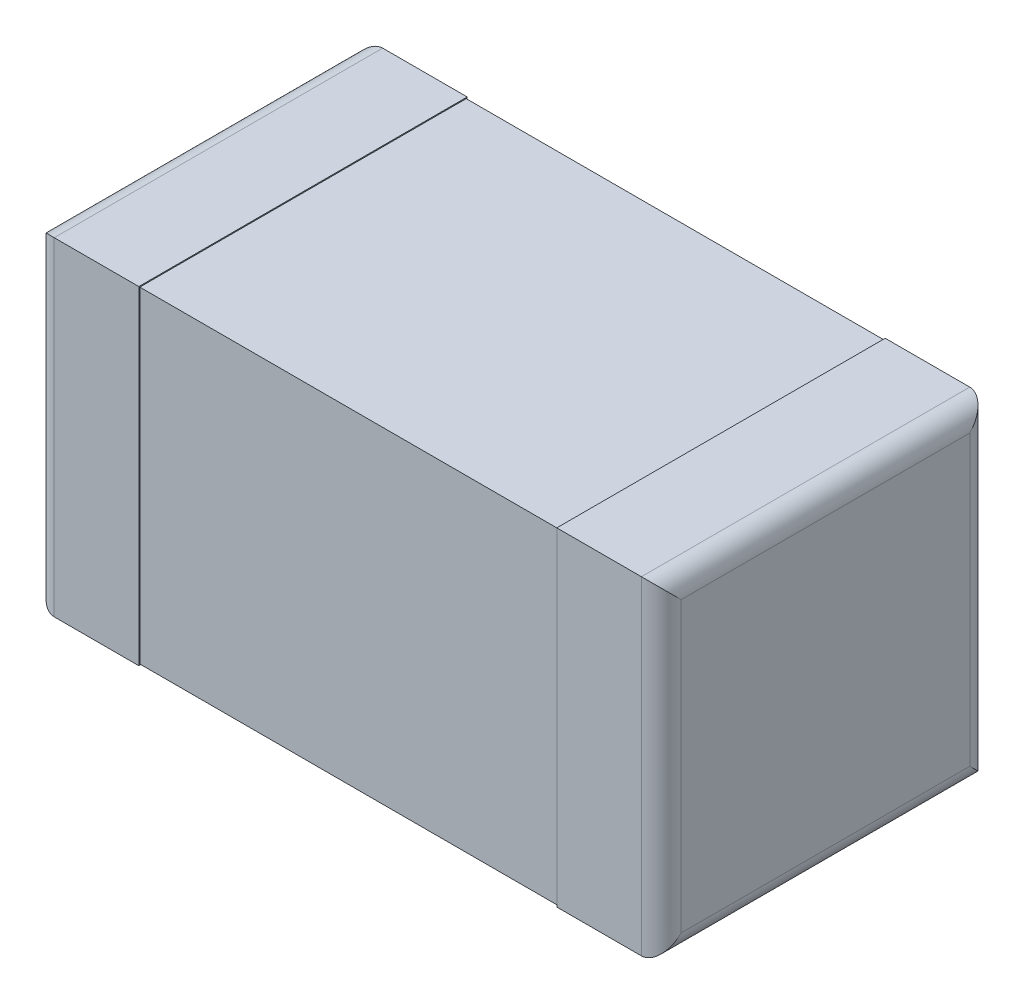
ISO-10303-21;
HEADER;
FILE_DESCRIPTION(('STEP AP214'),'2;1');
FILE_NAME('part.step','',(''),(''),'','','');
FILE_SCHEMA(('AUTOMOTIVE_DESIGN { 1 0 10303 214 1 1 1 1 }'));
ENDSEC;
DATA;
#1=APPLICATION_CONTEXT('core data for automotive mechanical design processes');
#2=APPLICATION_PROTOCOL_DEFINITION('international standard','automotive_design',2000,#1);
#3=PRODUCT_CONTEXT('',#1,'mechanical');
#4=PRODUCT('Part','Part','',(#3));
#5=PRODUCT_RELATED_PRODUCT_CATEGORY('part','',(#4));
#6=PRODUCT_DEFINITION_FORMATION('','',#4);
#7=PRODUCT_DEFINITION_CONTEXT('part definition',#1,'design');
#8=PRODUCT_DEFINITION('design','',#6,#7);
#9=PRODUCT_DEFINITION_SHAPE('','',#8);
#10=(LENGTH_UNIT() NAMED_UNIT(*) SI_UNIT(.MILLI.,.METRE.));
#11=(NAMED_UNIT(*) PLANE_ANGLE_UNIT() SI_UNIT($,.RADIAN.));
#12=(NAMED_UNIT(*) SI_UNIT($,.STERADIAN.) SOLID_ANGLE_UNIT());
#13=UNCERTAINTY_MEASURE_WITH_UNIT(LENGTH_MEASURE(1.E-05),#10,'distance_accuracy_value','');
#14=(GEOMETRIC_REPRESENTATION_CONTEXT(3) GLOBAL_UNCERTAINTY_ASSIGNED_CONTEXT((#13)) GLOBAL_UNIT_ASSIGNED_CONTEXT((#10,
#11,#12)) REPRESENTATION_CONTEXT('',''));
#15=CARTESIAN_POINT('',(0.,0.,0.));
#16=DIRECTION('',(0.,0.,1.));
#17=DIRECTION('',(1.,0.,0.));
#18=AXIS2_PLACEMENT_3D('',#15,#16,#17);
#19=CARTESIAN_POINT('',(0.,0.8382,0.8382));
#20=DIRECTION('',(1.,0.,0.));
#21=DIRECTION('',(0.,1.,0.));
#22=AXIS2_PLACEMENT_3D('',#19,#20,#21);
#23=PLANE('',#22);
#24=DIRECTION('',(0.,0.,-1.));
#25=VECTOR('',#24,1.);
#26=CARTESIAN_POINT('',(0.,0.0508,0.8382));
#27=LINE('',#26,#25);
#28=CARTESIAN_POINT('',(0.,0.0508,0.7874));
#29=VERTEX_POINT('',#28);
#30=CARTESIAN_POINT('',(0.,0.0508,0.0508));
#31=VERTEX_POINT('',#30);
#32=EDGE_CURVE('E195',#29,#31,#27,.T.);
#33=ORIENTED_EDGE('',*,*,#32,.F.);
#34=DIRECTION('',(0.,1.,0.));
#35=VECTOR('',#34,1.);
#36=CARTESIAN_POINT('',(0.,0.,0.7874));
#37=LINE('',#36,#35);
#38=CARTESIAN_POINT('',(0.,0.7874,0.7874));
#39=VERTEX_POINT('',#38);
#40=EDGE_CURVE('E154',#39,#29,#37,.F.);
#41=ORIENTED_EDGE('',*,*,#40,.F.);
#42=DIRECTION('',(0.,0.,-1.));
#43=VECTOR('',#42,1.);
#44=CARTESIAN_POINT('',(0.,0.7874,0.8382));
#45=LINE('',#44,#43);
#46=CARTESIAN_POINT('',(0.,0.7874,0.0508));
#47=VERTEX_POINT('',#46);
#48=EDGE_CURVE('E151',#47,#39,#45,.F.);
#49=ORIENTED_EDGE('',*,*,#48,.F.);
#50=DIRECTION('',(0.,-1.,0.));
#51=VECTOR('',#50,1.);
#52=CARTESIAN_POINT('',(0.,0.8382,0.0508));
#53=LINE('',#52,#51);
#54=EDGE_CURVE('E193',#31,#47,#53,.F.);
#55=ORIENTED_EDGE('',*,*,#54,.F.);
#56=EDGE_LOOP('',(#33,#41,#49,#55));
#57=FACE_BOUND('',#56,.T.);
#58=ADVANCED_FACE('F17',(#57),#23,.F.);
#59=CARTESIAN_POINT('',(1.6002,0.,0.8382));
#60=DIRECTION('',(-1.,0.,0.));
#61=DIRECTION('',(0.,0.,1.));
#62=AXIS2_PLACEMENT_3D('',#59,#60,#61);
#63=PLANE('',#62);
#64=DIRECTION('',(0.,0.,-1.));
#65=VECTOR('',#64,1.);
#66=CARTESIAN_POINT('',(1.6002,0.7874,0.8382));
#67=LINE('',#66,#65);
#68=CARTESIAN_POINT('',(1.6002,0.7874,0.7874));
#69=VERTEX_POINT('',#68);
#70=CARTESIAN_POINT('',(1.6002,0.7874,0.0508));
#71=VERTEX_POINT('',#70);
#72=EDGE_CURVE('E181',#69,#71,#67,.T.);
#73=ORIENTED_EDGE('',*,*,#72,.F.);
#74=DIRECTION('',(0.,-1.,0.));
#75=VECTOR('',#74,1.);
#76=CARTESIAN_POINT('',(1.6002,0.,0.7874));
#77=LINE('',#76,#75);
#78=CARTESIAN_POINT('',(1.6002,0.0508,0.7874));
#79=VERTEX_POINT('',#78);
#80=EDGE_CURVE('E185',#79,#69,#77,.F.);
#81=ORIENTED_EDGE('',*,*,#80,.F.);
#82=DIRECTION('',(0.,0.,-1.));
#83=VECTOR('',#82,1.);
#84=CARTESIAN_POINT('',(1.6002,0.0508,0.8382));
#85=LINE('',#84,#83);
#86=CARTESIAN_POINT('',(1.6002,0.0508,0.0508));
#87=VERTEX_POINT('',#86);
#88=EDGE_CURVE('E189',#87,#79,#85,.F.);
#89=ORIENTED_EDGE('',*,*,#88,.F.);
#90=DIRECTION('',(0.,1.,0.));
#91=VECTOR('',#90,1.);
#92=CARTESIAN_POINT('',(1.6002,0.,0.0508));
#93=LINE('',#92,#91);
#94=EDGE_CURVE('E138',#71,#87,#93,.F.);
#95=ORIENTED_EDGE('',*,*,#94,.F.);
#96=EDGE_LOOP('',(#73,#81,#89,#95));
#97=FACE_BOUND('',#96,.T.);
#98=ADVANCED_FACE('F340',(#97),#63,.F.);
#99=CARTESIAN_POINT('',(0.0508,0.7874,0.8382));
#100=DIRECTION('',(0.,0.,-1.));
#101=DIRECTION('',(-1.,0.,0.));
#102=AXIS2_PLACEMENT_3D('',#99,#100,#101);
#103=CYLINDRICAL_SURFACE('',#102,0.0508);
#104=CARTESIAN_POINT('',(0.0508,0.7874,0.7874));
#105=DIRECTION('',(0.,0.707106781186547,-0.707106781186547));
#106=DIRECTION('',(0.,0.707106781186547,0.707106781186547));
#107=AXIS2_PLACEMENT_3D('',#104,#105,#106);
#108=ELLIPSE('',#107,0.0718420489685532,0.0508);
#109=CARTESIAN_POINT('',(0.0508,0.8382,0.8382));
#110=VERTEX_POINT('',#109);
#111=EDGE_CURVE('E20',#110,#39,#108,.F.);
#112=ORIENTED_EDGE('',*,*,#111,.F.);
#113=DIRECTION('',(0.,0.,1.));
#114=VECTOR('',#113,1.);
#115=CARTESIAN_POINT('',(0.0507999999999999,0.8382,0.8382));
#116=LINE('',#115,#114);
#117=CARTESIAN_POINT('',(0.0508,0.8382,0.));
#118=VERTEX_POINT('',#117);
#119=EDGE_CURVE('E127',#110,#118,#116,.F.);
#120=ORIENTED_EDGE('',*,*,#119,.T.);
#121=CARTESIAN_POINT('',(0.0508,0.7874,0.0508));
#122=DIRECTION('',(0.,-0.707106781186547,-0.707106781186547));
#123=DIRECTION('',(0.,-0.707106781186547,0.707106781186547));
#124=AXIS2_PLACEMENT_3D('',#121,#122,#123);
#125=ELLIPSE('',#124,0.0718420489685532,0.0508);
#126=EDGE_CURVE('E194',#47,#118,#125,.T.);
#127=ORIENTED_EDGE('',*,*,#126,.F.);
#128=ORIENTED_EDGE('',*,*,#48,.T.);
#129=EDGE_LOOP('',(#112,#120,#127,#128));
#130=FACE_BOUND('',#129,.T.);
#131=ADVANCED_FACE('F150',(#130),#103,.T.);
#132=CARTESIAN_POINT('',(0.0508,0.,0.7874));
#133=DIRECTION('',(0.,1.,0.));
#134=DIRECTION('',(-1.,0.,0.));
#135=AXIS2_PLACEMENT_3D('',#132,#133,#134);
#136=CYLINDRICAL_SURFACE('',#135,0.0508);
#137=CARTESIAN_POINT('',(0.0508,0.0508,0.7874));
#138=DIRECTION('',(0.,-0.707106781186547,-0.707106781186547));
#139=DIRECTION('',(0.,0.707106781186547,-0.707106781186547));
#140=AXIS2_PLACEMENT_3D('',#137,#138,#139);
#141=ELLIPSE('',#140,0.0718420489685532,0.0508);
#142=CARTESIAN_POINT('',(0.0507999999999999,0.,0.8382));
#143=VERTEX_POINT('',#142);
#144=EDGE_CURVE('E157',#143,#29,#141,.T.);
#145=ORIENTED_EDGE('',*,*,#144,.F.);
#146=DIRECTION('',(0.,1.,0.));
#147=VECTOR('',#146,1.);
#148=CARTESIAN_POINT('',(0.0507999999999999,0.,0.8382));
#149=LINE('',#148,#147);
#150=EDGE_CURVE('E144',#110,#143,#149,.F.);
#151=ORIENTED_EDGE('',*,*,#150,.F.);
#152=ORIENTED_EDGE('',*,*,#111,.T.);
#153=ORIENTED_EDGE('',*,*,#40,.T.);
#154=EDGE_LOOP('',(#145,#151,#152,#153));
#155=FACE_BOUND('',#154,.T.);
#156=ADVANCED_FACE('F155',(#155),#136,.T.);
#157=CARTESIAN_POINT('',(0.0508,0.0508,0.8382));
#158=DIRECTION('',(0.,0.,-1.));
#159=DIRECTION('',(-1.,0.,0.));
#160=AXIS2_PLACEMENT_3D('',#157,#158,#159);
#161=CYLINDRICAL_SURFACE('',#160,0.0508);
#162=CARTESIAN_POINT('',(0.0508,0.0508,0.0508));
#163=DIRECTION('',(0.,-0.707106781186547,0.707106781186547));
#164=DIRECTION('',(0.,-0.707106781186547,-0.707106781186547));
#165=AXIS2_PLACEMENT_3D('',#162,#163,#164);
#166=ELLIPSE('',#165,0.0718420489685532,0.0508);
#167=CARTESIAN_POINT('',(0.0508,0.,0.));
#168=VERTEX_POINT('',#167);
#169=EDGE_CURVE('E190',#168,#31,#166,.F.);
#170=ORIENTED_EDGE('',*,*,#169,.F.);
#171=DIRECTION('',(0.,0.,1.));
#172=VECTOR('',#171,1.);
#173=CARTESIAN_POINT('',(0.0508,0.,0.8382));
#174=LINE('',#173,#172);
#175=EDGE_CURVE('E159',#168,#143,#174,.T.);
#176=ORIENTED_EDGE('',*,*,#175,.T.);
#177=ORIENTED_EDGE('',*,*,#144,.T.);
#178=ORIENTED_EDGE('',*,*,#32,.T.);
#179=EDGE_LOOP('',(#170,#176,#177,#178));
#180=FACE_BOUND('',#179,.T.);
#181=ADVANCED_FACE('F545',(#180),#161,.T.);
#182=CARTESIAN_POINT('',(0.0508,0.8382,0.0508));
#183=DIRECTION('',(0.,-1.,0.));
#184=DIRECTION('',(1.,0.,0.));
#185=AXIS2_PLACEMENT_3D('',#182,#183,#184);
#186=CYLINDRICAL_SURFACE('',#185,0.0508);
#187=ORIENTED_EDGE('',*,*,#169,.T.);
#188=ORIENTED_EDGE('',*,*,#54,.T.);
#189=ORIENTED_EDGE('',*,*,#126,.T.);
#190=DIRECTION('',(0.,1.,0.));
#191=VECTOR('',#190,1.);
#192=CARTESIAN_POINT('',(0.0507999999999999,0.,0.));
#193=LINE('',#192,#191);
#194=EDGE_CURVE('E214',#118,#168,#193,.F.);
#195=ORIENTED_EDGE('',*,*,#194,.T.);
#196=EDGE_LOOP('',(#187,#188,#189,#195));
#197=FACE_BOUND('',#196,.T.);
#198=ADVANCED_FACE('F354',(#197),#186,.T.);
#199=CARTESIAN_POINT('',(1.5494,0.0508,0.8382));
#200=DIRECTION('',(0.,0.,-1.));
#201=DIRECTION('',(-1.,0.,0.));
#202=AXIS2_PLACEMENT_3D('',#199,#200,#201);
#203=CYLINDRICAL_SURFACE('',#202,0.0508);
#204=CARTESIAN_POINT('',(1.5494,0.0508,0.7874));
#205=DIRECTION('',(0.,-0.707106781186547,-0.707106781186547));
#206=DIRECTION('',(0.,-0.707106781186547,0.707106781186547));
#207=AXIS2_PLACEMENT_3D('',#204,#205,#206);
#208=ELLIPSE('',#207,0.0718420489685532,0.0508);
#209=CARTESIAN_POINT('',(1.5494,0.,0.8382));
#210=VERTEX_POINT('',#209);
#211=EDGE_CURVE('E186',#210,#79,#208,.F.);
#212=ORIENTED_EDGE('',*,*,#211,.F.);
#213=DIRECTION('',(0.,0.,1.));
#214=VECTOR('',#213,1.);
#215=CARTESIAN_POINT('',(1.5494,0.,0.8382));
#216=LINE('',#215,#214);
#217=CARTESIAN_POINT('',(1.5494,0.,0.));
#218=VERTEX_POINT('',#217);
#219=EDGE_CURVE('E213',#210,#218,#216,.F.);
#220=ORIENTED_EDGE('',*,*,#219,.T.);
#221=CARTESIAN_POINT('',(1.5494,0.0508,0.0508));
#222=DIRECTION('',(0.,0.707106781186547,-0.707106781186547));
#223=DIRECTION('',(0.,0.707106781186547,0.707106781186547));
#224=AXIS2_PLACEMENT_3D('',#221,#222,#223);
#225=ELLIPSE('',#224,0.0718420489685532,0.0508);
#226=EDGE_CURVE('E179',#87,#218,#225,.T.);
#227=ORIENTED_EDGE('',*,*,#226,.F.);
#228=ORIENTED_EDGE('',*,*,#88,.T.);
#229=EDGE_LOOP('',(#212,#220,#227,#228));
#230=FACE_BOUND('',#229,.T.);
#231=ADVANCED_FACE('F343',(#230),#203,.T.);
#232=CARTESIAN_POINT('',(1.5494,0.,0.7874));
#233=DIRECTION('',(0.,-1.,0.));
#234=DIRECTION('',(0.,0.,-1.));
#235=AXIS2_PLACEMENT_3D('',#232,#233,#234);
#236=CYLINDRICAL_SURFACE('',#235,0.0508);
#237=CARTESIAN_POINT('',(1.5494,0.7874,0.7874));
#238=DIRECTION('',(0.,0.707106781186547,-0.707106781186547));
#239=DIRECTION('',(0.,-0.707106781186547,-0.707106781186547));
#240=AXIS2_PLACEMENT_3D('',#237,#238,#239);
#241=ELLIPSE('',#240,0.0718420489685532,0.0508);
#242=CARTESIAN_POINT('',(1.5494,0.8382,0.8382));
#243=VERTEX_POINT('',#242);
#244=EDGE_CURVE('E182',#243,#69,#241,.T.);
#245=ORIENTED_EDGE('',*,*,#244,.F.);
#246=DIRECTION('',(0.,1.,0.));
#247=VECTOR('',#246,1.);
#248=CARTESIAN_POINT('',(1.5494,0.,0.8382));
#249=LINE('',#248,#247);
#250=EDGE_CURVE('E234',#210,#243,#249,.T.);
#251=ORIENTED_EDGE('',*,*,#250,.F.);
#252=ORIENTED_EDGE('',*,*,#211,.T.);
#253=ORIENTED_EDGE('',*,*,#80,.T.);
#254=EDGE_LOOP('',(#245,#251,#252,#253));
#255=FACE_BOUND('',#254,.T.);
#256=ADVANCED_FACE('F345',(#255),#236,.T.);
#257=CARTESIAN_POINT('',(1.5494,0.7874,0.8382));
#258=DIRECTION('',(0.,0.,-1.));
#259=DIRECTION('',(-1.,0.,0.));
#260=AXIS2_PLACEMENT_3D('',#257,#258,#259);
#261=CYLINDRICAL_SURFACE('',#260,0.0508);
#262=CARTESIAN_POINT('',(1.5494,0.7874,0.0508));
#263=DIRECTION('',(0.,0.707106781186547,0.707106781186547));
#264=DIRECTION('',(0.,0.707106781186547,-0.707106781186547));
#265=AXIS2_PLACEMENT_3D('',#262,#263,#264);
#266=ELLIPSE('',#265,0.0718420489685532,0.0508);
#267=CARTESIAN_POINT('',(1.5494,0.8382,0.));
#268=VERTEX_POINT('',#267);
#269=EDGE_CURVE('E176',#268,#71,#266,.F.);
#270=ORIENTED_EDGE('',*,*,#269,.F.);
#271=DIRECTION('',(0.,0.,1.));
#272=VECTOR('',#271,1.);
#273=CARTESIAN_POINT('',(1.5494,0.8382,0.8382));
#274=LINE('',#273,#272);
#275=EDGE_CURVE('E237',#268,#243,#274,.T.);
#276=ORIENTED_EDGE('',*,*,#275,.T.);
#277=ORIENTED_EDGE('',*,*,#244,.T.);
#278=ORIENTED_EDGE('',*,*,#72,.T.);
#279=EDGE_LOOP('',(#270,#276,#277,#278));
#280=FACE_BOUND('',#279,.T.);
#281=ADVANCED_FACE('F333',(#280),#261,.T.);
#282=CARTESIAN_POINT('',(1.5494,0.,0.0508));
#283=DIRECTION('',(0.,1.,0.));
#284=DIRECTION('',(0.,0.,1.));
#285=AXIS2_PLACEMENT_3D('',#282,#283,#284);
#286=CYLINDRICAL_SURFACE('',#285,0.0508);
#287=ORIENTED_EDGE('',*,*,#269,.T.);
#288=ORIENTED_EDGE('',*,*,#94,.T.);
#289=ORIENTED_EDGE('',*,*,#226,.T.);
#290=DIRECTION('',(0.,1.,0.));
#291=VECTOR('',#290,1.);
#292=CARTESIAN_POINT('',(1.5494,0.,0.));
#293=LINE('',#292,#291);
#294=EDGE_CURVE('E260',#218,#268,#293,.T.);
#295=ORIENTED_EDGE('',*,*,#294,.T.);
#296=EDGE_LOOP('',(#287,#288,#289,#295));
#297=FACE_BOUND('',#296,.T.);
#298=ADVANCED_FACE('F337',(#297),#286,.T.);
#299=CARTESIAN_POINT('',(1.6002,0.8382,0.8382));
#300=DIRECTION('',(0.,-1.,0.));
#301=DIRECTION('',(1.,0.,0.));
#302=AXIS2_PLACEMENT_3D('',#299,#300,#301);
#303=PLANE('',#302);
#304=ORIENTED_EDGE('',*,*,#119,.F.);
#305=DIRECTION('',(1.,0.,0.));
#306=VECTOR('',#305,1.);
#307=CARTESIAN_POINT('',(0.,0.8382,0.8382));
#308=LINE('',#307,#306);
#309=CARTESIAN_POINT('',(0.2667,0.8382,0.8382));
#310=VERTEX_POINT('',#309);
#311=EDGE_CURVE('E131',#310,#110,#308,.F.);
#312=ORIENTED_EDGE('',*,*,#311,.F.);
#313=DIRECTION('',(0.,0.,1.));
#314=VECTOR('',#313,1.);
#315=CARTESIAN_POINT('',(0.2667,0.8382,0.83566));
#316=LINE('',#315,#314);
#317=CARTESIAN_POINT('',(0.2667,0.8382,0.));
#318=VERTEX_POINT('',#317);
#319=EDGE_CURVE('E172',#318,#310,#316,.T.);
#320=ORIENTED_EDGE('',*,*,#319,.F.);
#321=DIRECTION('',(1.,0.,0.));
#322=VECTOR('',#321,1.);
#323=CARTESIAN_POINT('',(0.,0.8382,0.));
#324=LINE('',#323,#322);
#325=EDGE_CURVE('E133',#318,#118,#324,.F.);
#326=ORIENTED_EDGE('',*,*,#325,.T.);
#327=EDGE_LOOP('',(#304,#312,#320,#326));
#328=FACE_BOUND('',#327,.T.);
#329=ADVANCED_FACE('F129',(#328),#303,.F.);
#330=CARTESIAN_POINT('',(0.,0.,0.8382));
#331=DIRECTION('',(0.,0.,1.));
#332=DIRECTION('',(1.,0.,0.));
#333=AXIS2_PLACEMENT_3D('',#330,#331,#332);
#334=PLANE('',#333);
#335=DIRECTION('',(1.,0.,0.));
#336=VECTOR('',#335,1.);
#337=CARTESIAN_POINT('',(0.,0.,0.8382));
#338=LINE('',#337,#336);
#339=CARTESIAN_POINT('',(0.2667,0.,0.8382));
#340=VERTEX_POINT('',#339);
#341=EDGE_CURVE('E162',#143,#340,#338,.T.);
#342=ORIENTED_EDGE('',*,*,#341,.T.);
#343=DIRECTION('',(0.,1.,0.));
#344=VECTOR('',#343,1.);
#345=CARTESIAN_POINT('',(0.2667,0.,0.8382));
#346=LINE('',#345,#344);
#347=EDGE_CURVE('E146',#310,#340,#346,.F.);
#348=ORIENTED_EDGE('',*,*,#347,.F.);
#349=ORIENTED_EDGE('',*,*,#311,.T.);
#350=ORIENTED_EDGE('',*,*,#150,.T.);
#351=EDGE_LOOP('',(#342,#348,#349,#350));
#352=FACE_BOUND('',#351,.T.);
#353=ADVANCED_FACE('F142',(#352),#334,.T.);
#354=CARTESIAN_POINT('',(0.,0.,0.8382));
#355=DIRECTION('',(0.,1.,0.));
#356=DIRECTION('',(0.,0.,1.));
#357=AXIS2_PLACEMENT_3D('',#354,#355,#356);
#358=PLANE('',#357);
#359=ORIENTED_EDGE('',*,*,#175,.F.);
#360=DIRECTION('',(1.,0.,0.));
#361=VECTOR('',#360,1.);
#362=CARTESIAN_POINT('',(0.,0.,0.));
#363=LINE('',#362,#361);
#364=CARTESIAN_POINT('',(0.2667,0.,0.));
#365=VERTEX_POINT('',#364);
#366=EDGE_CURVE('E210',#168,#365,#363,.T.);
#367=ORIENTED_EDGE('',*,*,#366,.T.);
#368=DIRECTION('',(0.,0.,1.));
#369=VECTOR('',#368,1.);
#370=CARTESIAN_POINT('',(0.2667,0.,0.83566));
#371=LINE('',#370,#369);
#372=EDGE_CURVE('E171',#340,#365,#371,.F.);
#373=ORIENTED_EDGE('',*,*,#372,.F.);
#374=ORIENTED_EDGE('',*,*,#341,.F.);
#375=EDGE_LOOP('',(#359,#367,#373,#374));
#376=FACE_BOUND('',#375,.T.);
#377=ADVANCED_FACE('F382',(#376),#358,.F.);
#378=CARTESIAN_POINT('',(0.,0.,0.));
#379=DIRECTION('',(0.,0.,1.));
#380=DIRECTION('',(1.,0.,0.));
#381=AXIS2_PLACEMENT_3D('',#378,#379,#380);
#382=PLANE('',#381);
#383=ORIENTED_EDGE('',*,*,#194,.F.);
#384=ORIENTED_EDGE('',*,*,#325,.F.);
#385=DIRECTION('',(0.,1.,0.));
#386=VECTOR('',#385,1.);
#387=CARTESIAN_POINT('',(0.2667,0.,0.));
#388=LINE('',#387,#386);
#389=EDGE_CURVE('E206',#365,#318,#388,.T.);
#390=ORIENTED_EDGE('',*,*,#389,.F.);
#391=ORIENTED_EDGE('',*,*,#366,.F.);
#392=EDGE_LOOP('',(#383,#384,#390,#391));
#393=FACE_BOUND('',#392,.T.);
#394=ADVANCED_FACE('F379',(#393),#382,.F.);
#395=CARTESIAN_POINT('',(0.,0.,0.8382));
#396=DIRECTION('',(0.,1.,0.));
#397=DIRECTION('',(0.,0.,1.));
#398=AXIS2_PLACEMENT_3D('',#395,#396,#397);
#399=PLANE('',#398);
#400=ORIENTED_EDGE('',*,*,#219,.F.);
#401=DIRECTION('',(1.,0.,0.));
#402=VECTOR('',#401,1.);
#403=CARTESIAN_POINT('',(0.,0.,0.8382));
#404=LINE('',#403,#402);
#405=CARTESIAN_POINT('',(1.3335,0.,0.8382));
#406=VERTEX_POINT('',#405);
#407=EDGE_CURVE('E231',#406,#210,#404,.T.);
#408=ORIENTED_EDGE('',*,*,#407,.F.);
#409=DIRECTION('',(0.,0.,1.));
#410=VECTOR('',#409,1.);
#411=CARTESIAN_POINT('',(1.3335,0.,0.83566));
#412=LINE('',#411,#410);
#413=CARTESIAN_POINT('',(1.3335,0.,0.));
#414=VERTEX_POINT('',#413);
#415=EDGE_CURVE('E228',#414,#406,#412,.T.);
#416=ORIENTED_EDGE('',*,*,#415,.F.);
#417=DIRECTION('',(1.,0.,0.));
#418=VECTOR('',#417,1.);
#419=CARTESIAN_POINT('',(0.,0.,0.));
#420=LINE('',#419,#418);
#421=EDGE_CURVE('E241',#414,#218,#420,.T.);
#422=ORIENTED_EDGE('',*,*,#421,.T.);
#423=EDGE_LOOP('',(#400,#408,#416,#422));
#424=FACE_BOUND('',#423,.T.);
#425=ADVANCED_FACE('F325',(#424),#399,.F.);
#426=CARTESIAN_POINT('',(0.,0.,0.8382));
#427=DIRECTION('',(0.,0.,1.));
#428=DIRECTION('',(1.,0.,0.));
#429=AXIS2_PLACEMENT_3D('',#426,#427,#428);
#430=PLANE('',#429);
#431=DIRECTION('',(1.,0.,0.));
#432=VECTOR('',#431,1.);
#433=CARTESIAN_POINT('',(1.6002,0.8382,0.8382));
#434=LINE('',#433,#432);
#435=CARTESIAN_POINT('',(1.3335,0.8382,0.8382));
#436=VERTEX_POINT('',#435);
#437=EDGE_CURVE('E238',#243,#436,#434,.F.);
#438=ORIENTED_EDGE('',*,*,#437,.T.);
#439=DIRECTION('',(0.,1.,0.));
#440=VECTOR('',#439,1.);
#441=CARTESIAN_POINT('',(1.3335,0.8382,0.8382));
#442=LINE('',#441,#440);
#443=EDGE_CURVE('E225',#406,#436,#442,.T.);
#444=ORIENTED_EDGE('',*,*,#443,.F.);
#445=ORIENTED_EDGE('',*,*,#407,.T.);
#446=ORIENTED_EDGE('',*,*,#250,.T.);
#447=EDGE_LOOP('',(#438,#444,#445,#446));
#448=FACE_BOUND('',#447,.T.);
#449=ADVANCED_FACE('F329',(#448),#430,.T.);
#450=CARTESIAN_POINT('',(1.6002,0.8382,0.8382));
#451=DIRECTION('',(0.,-1.,0.));
#452=DIRECTION('',(1.,0.,0.));
#453=AXIS2_PLACEMENT_3D('',#450,#451,#452);
#454=PLANE('',#453);
#455=ORIENTED_EDGE('',*,*,#275,.F.);
#456=DIRECTION('',(1.,0.,0.));
#457=VECTOR('',#456,1.);
#458=CARTESIAN_POINT('',(0.,0.8382,0.));
#459=LINE('',#458,#457);
#460=CARTESIAN_POINT('',(1.3335,0.8382,0.));
#461=VERTEX_POINT('',#460);
#462=EDGE_CURVE('E257',#268,#461,#459,.F.);
#463=ORIENTED_EDGE('',*,*,#462,.T.);
#464=DIRECTION('',(0.,0.,1.));
#465=VECTOR('',#464,1.);
#466=CARTESIAN_POINT('',(1.3335,0.8382,0.83566));
#467=LINE('',#466,#465);
#468=EDGE_CURVE('E227',#436,#461,#467,.F.);
#469=ORIENTED_EDGE('',*,*,#468,.F.);
#470=ORIENTED_EDGE('',*,*,#437,.F.);
#471=EDGE_LOOP('',(#455,#463,#469,#470));
#472=FACE_BOUND('',#471,.T.);
#473=ADVANCED_FACE('F319',(#472),#454,.F.);
#474=CARTESIAN_POINT('',(0.,0.,0.));
#475=DIRECTION('',(0.,0.,1.));
#476=DIRECTION('',(1.,0.,0.));
#477=AXIS2_PLACEMENT_3D('',#474,#475,#476);
#478=PLANE('',#477);
#479=ORIENTED_EDGE('',*,*,#294,.F.);
#480=ORIENTED_EDGE('',*,*,#421,.F.);
#481=DIRECTION('',(0.,1.,0.));
#482=VECTOR('',#481,1.);
#483=CARTESIAN_POINT('',(1.3335,0.8382,0.));
#484=LINE('',#483,#482);
#485=EDGE_CURVE('E249',#461,#414,#484,.F.);
#486=ORIENTED_EDGE('',*,*,#485,.F.);
#487=ORIENTED_EDGE('',*,*,#462,.F.);
#488=EDGE_LOOP('',(#479,#480,#486,#487));
#489=FACE_BOUND('',#488,.T.);
#490=ADVANCED_FACE('F323',(#489),#478,.F.);
#491=CARTESIAN_POINT('',(0.2667,1.99143127423469,0.0025399999999999));
#492=DIRECTION('',(0.,0.,-1.));
#493=DIRECTION('',(-1.,0.,0.));
#494=AXIS2_PLACEMENT_3D('',#491,#492,#493);
#495=PLANE('',#494);
#496=DIRECTION('',(1.,0.,0.));
#497=VECTOR('',#496,1.);
#498=CARTESIAN_POINT('',(0.2667,0.83566,0.00253999999999988));
#499=LINE('',#498,#497);
#500=CARTESIAN_POINT('',(0.2667,0.83566,0.00253999999999988));
#501=VERTEX_POINT('',#500);
#502=CARTESIAN_POINT('',(1.3335,0.83566,0.00253999999999989));
#503=VERTEX_POINT('',#502);
#504=EDGE_CURVE('E246',#501,#503,#499,.T.);
#505=ORIENTED_EDGE('',*,*,#504,.T.);
#506=DIRECTION('',(0.,1.,0.));
#507=VECTOR('',#506,1.);
#508=CARTESIAN_POINT('',(1.3335,0.8382,0.00253999999999988));
#509=LINE('',#508,#507);
#510=CARTESIAN_POINT('',(1.3335,0.00254000000000005,0.00253999999999989));
#511=VERTEX_POINT('',#510);
#512=EDGE_CURVE('E252',#511,#503,#509,.T.);
#513=ORIENTED_EDGE('',*,*,#512,.F.);
#514=DIRECTION('',(-1.,0.,0.));
#515=VECTOR('',#514,1.);
#516=CARTESIAN_POINT('',(1.3335,0.00254000000000001,0.00253999999999988));
#517=LINE('',#516,#515);
#518=CARTESIAN_POINT('',(0.2667,0.00254000000000004,0.00253999999999989));
#519=VERTEX_POINT('',#518);
#520=EDGE_CURVE('E203',#511,#519,#517,.T.);
#521=ORIENTED_EDGE('',*,*,#520,.T.);
#522=DIRECTION('',(0.,1.,0.));
#523=VECTOR('',#522,1.);
#524=CARTESIAN_POINT('',(0.2667,0.,0.00253999999999988));
#525=LINE('',#524,#523);
#526=EDGE_CURVE('E208',#501,#519,#525,.F.);
#527=ORIENTED_EDGE('',*,*,#526,.F.);
#528=EDGE_LOOP('',(#505,#513,#521,#527));
#529=FACE_BOUND('',#528,.T.);
#530=ADVANCED_FACE('F367',(#529),#495,.T.);
#531=CARTESIAN_POINT('',(1.3335,0.00254000000000001,-1.15577127423469));
#532=DIRECTION('',(0.,1.,0.));
#533=DIRECTION('',(-1.,0.,0.));
#534=AXIS2_PLACEMENT_3D('',#531,#532,#533);
#535=PLANE('',#534);
#536=DIRECTION('',(0.,0.,1.));
#537=VECTOR('',#536,1.);
#538=CARTESIAN_POINT('',(1.3335,0.00253999999999999,0.83566));
#539=LINE('',#538,#537);
#540=CARTESIAN_POINT('',(1.3335,0.00254,0.83566));
#541=VERTEX_POINT('',#540);
#542=EDGE_CURVE('E283',#541,#511,#539,.F.);
#543=ORIENTED_EDGE('',*,*,#542,.F.);
#544=DIRECTION('',(-1.,0.,0.));
#545=VECTOR('',#544,1.);
#546=CARTESIAN_POINT('',(0.,0.00254000000000001,0.83566));
#547=LINE('',#546,#545);
#548=CARTESIAN_POINT('',(0.2667,0.00253999999999996,0.83566));
#549=VERTEX_POINT('',#548);
#550=EDGE_CURVE('E286',#541,#549,#547,.T.);
#551=ORIENTED_EDGE('',*,*,#550,.T.);
#552=DIRECTION('',(0.,0.,1.));
#553=VECTOR('',#552,1.);
#554=CARTESIAN_POINT('',(0.2667,0.00254000000000009,0.83566));
#555=LINE('',#554,#553);
#556=EDGE_CURVE('E273',#519,#549,#555,.T.);
#557=ORIENTED_EDGE('',*,*,#556,.F.);
#558=ORIENTED_EDGE('',*,*,#520,.F.);
#559=EDGE_LOOP('',(#543,#551,#557,#558));
#560=FACE_BOUND('',#559,.T.);
#561=ADVANCED_FACE('F306',(#560),#535,.F.);
#562=CARTESIAN_POINT('',(0.2667,0.,0.83566));
#563=DIRECTION('',(1.,0.,0.));
#564=DIRECTION('',(0.,1.,0.));
#565=AXIS2_PLACEMENT_3D('',#562,#563,#564);
#566=PLANE('',#565);
#567=ORIENTED_EDGE('',*,*,#556,.T.);
#568=DIRECTION('',(0.,1.,0.));
#569=VECTOR('',#568,1.);
#570=CARTESIAN_POINT('',(0.2667,0.,0.83566));
#571=LINE('',#570,#569);
#572=CARTESIAN_POINT('',(0.2667,0.83566,0.83566));
#573=VERTEX_POINT('',#572);
#574=EDGE_CURVE('E289',#549,#573,#571,.T.);
#575=ORIENTED_EDGE('',*,*,#574,.T.);
#576=DIRECTION('',(0.,0.,-1.));
#577=VECTOR('',#576,1.);
#578=CARTESIAN_POINT('',(0.2667,0.83566,-1.15577127423469));
#579=LINE('',#578,#577);
#580=EDGE_CURVE('E275',#573,#501,#579,.T.);
#581=ORIENTED_EDGE('',*,*,#580,.T.);
#582=ORIENTED_EDGE('',*,*,#526,.T.);
#583=EDGE_LOOP('',(#567,#575,#581,#582));
#584=FACE_BOUND('',#583,.T.);
#585=ORIENTED_EDGE('',*,*,#372,.T.);
#586=ORIENTED_EDGE('',*,*,#389,.T.);
#587=ORIENTED_EDGE('',*,*,#319,.T.);
#588=ORIENTED_EDGE('',*,*,#347,.T.);
#589=EDGE_LOOP('',(#585,#586,#587,#588));
#590=FACE_BOUND('',#589,.T.);
#591=ADVANCED_FACE('F301',(#584,#590),#566,.T.);
#592=CARTESIAN_POINT('',(0.2667,0.83566,-1.15577127423469));
#593=DIRECTION('',(0.,-1.,0.));
#594=DIRECTION('',(0.,0.,-1.));
#595=AXIS2_PLACEMENT_3D('',#592,#593,#594);
#596=PLANE('',#595);
#597=ORIENTED_EDGE('',*,*,#580,.F.);
#598=DIRECTION('',(-1.,0.,0.));
#599=VECTOR('',#598,1.);
#600=CARTESIAN_POINT('',(0.,0.83566,0.83566));
#601=LINE('',#600,#599);
#602=CARTESIAN_POINT('',(1.3335,0.83566,0.83566));
#603=VERTEX_POINT('',#602);
#604=EDGE_CURVE('E26',#573,#603,#601,.F.);
#605=ORIENTED_EDGE('',*,*,#604,.T.);
#606=DIRECTION('',(0.,0.,1.));
#607=VECTOR('',#606,1.);
#608=CARTESIAN_POINT('',(1.3335,0.83566,0.83566));
#609=LINE('',#608,#607);
#610=EDGE_CURVE('E34',#503,#603,#609,.T.);
#611=ORIENTED_EDGE('',*,*,#610,.F.);
#612=ORIENTED_EDGE('',*,*,#504,.F.);
#613=EDGE_LOOP('',(#597,#605,#611,#612));
#614=FACE_BOUND('',#613,.T.);
#615=ADVANCED_FACE('F295',(#614),#596,.F.);
#616=CARTESIAN_POINT('',(1.3335,0.8382,0.83566));
#617=DIRECTION('',(-1.,0.,0.));
#618=DIRECTION('',(0.,0.,1.));
#619=AXIS2_PLACEMENT_3D('',#616,#617,#618);
#620=PLANE('',#619);
#621=DIRECTION('',(0.,1.,0.));
#622=VECTOR('',#621,1.);
#623=CARTESIAN_POINT('',(1.3335,0.,0.83566));
#624=LINE('',#623,#622);
#625=EDGE_CURVE('E11',#603,#541,#624,.F.);
#626=ORIENTED_EDGE('',*,*,#625,.T.);
#627=ORIENTED_EDGE('',*,*,#542,.T.);
#628=ORIENTED_EDGE('',*,*,#512,.T.);
#629=ORIENTED_EDGE('',*,*,#610,.T.);
#630=EDGE_LOOP('',(#626,#627,#628,#629));
#631=FACE_BOUND('',#630,.T.);
#632=ORIENTED_EDGE('',*,*,#468,.T.);
#633=ORIENTED_EDGE('',*,*,#485,.T.);
#634=ORIENTED_EDGE('',*,*,#415,.T.);
#635=ORIENTED_EDGE('',*,*,#443,.T.);
#636=EDGE_LOOP('',(#632,#633,#634,#635));
#637=FACE_BOUND('',#636,.T.);
#638=ADVANCED_FACE('F308',(#631,#637),#620,.T.);
#639=CARTESIAN_POINT('',(0.,0.,0.83566));
#640=DIRECTION('',(0.,0.,-1.));
#641=DIRECTION('',(-1.,0.,0.));
#642=AXIS2_PLACEMENT_3D('',#639,#640,#641);
#643=PLANE('',#642);
#644=ORIENTED_EDGE('',*,*,#604,.F.);
#645=ORIENTED_EDGE('',*,*,#574,.F.);
#646=ORIENTED_EDGE('',*,*,#550,.F.);
#647=ORIENTED_EDGE('',*,*,#625,.F.);
#648=EDGE_LOOP('',(#644,#645,#646,#647));
#649=FACE_BOUND('',#648,.T.);
#650=ADVANCED_FACE('F299',(#649),#643,.F.);
#651=CLOSED_SHELL('',(#58,#98,#131,#156,#181,#198,#231,#256,#281,#298,#329,#353,#377,#394,#425,
#449,#473,#490,#530,#561,#591,#615,#638,#650));
#652=MANIFOLD_SOLID_BREP('B1',#651);
#653=ADVANCED_BREP_SHAPE_REPRESENTATION('',(#18,#652),#14);
#654=SHAPE_DEFINITION_REPRESENTATION(#9,#653);
ENDSEC;
END-ISO-10303-21;
